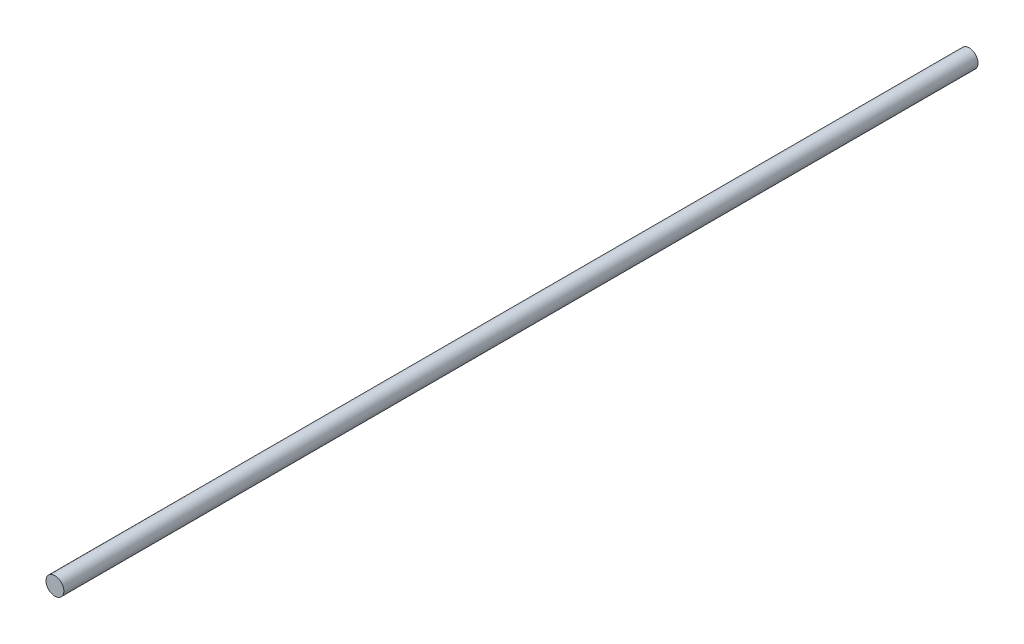
ISO-10303-21;
HEADER;
FILE_DESCRIPTION(('STEP AP214'),'2;1');
FILE_NAME('part.step','',(''),(''),'','','');
FILE_SCHEMA(('AUTOMOTIVE_DESIGN { 1 0 10303 214 1 1 1 1 }'));
ENDSEC;
DATA;
#1=APPLICATION_CONTEXT('core data for automotive mechanical design processes');
#2=APPLICATION_PROTOCOL_DEFINITION('international standard','automotive_design',2000,#1);
#3=PRODUCT_CONTEXT('',#1,'mechanical');
#4=PRODUCT('Part','Part','',(#3));
#5=PRODUCT_RELATED_PRODUCT_CATEGORY('part','',(#4));
#6=PRODUCT_DEFINITION_FORMATION('','',#4);
#7=PRODUCT_DEFINITION_CONTEXT('part definition',#1,'design');
#8=PRODUCT_DEFINITION('design','',#6,#7);
#9=PRODUCT_DEFINITION_SHAPE('','',#8);
#10=(LENGTH_UNIT() NAMED_UNIT(*) SI_UNIT(.MILLI.,.METRE.));
#11=(NAMED_UNIT(*) PLANE_ANGLE_UNIT() SI_UNIT($,.RADIAN.));
#12=(NAMED_UNIT(*) SI_UNIT($,.STERADIAN.) SOLID_ANGLE_UNIT());
#13=UNCERTAINTY_MEASURE_WITH_UNIT(LENGTH_MEASURE(1.E-05),#10,'distance_accuracy_value','');
#14=(GEOMETRIC_REPRESENTATION_CONTEXT(3) GLOBAL_UNCERTAINTY_ASSIGNED_CONTEXT((#13)) GLOBAL_UNIT_ASSIGNED_CONTEXT((#10,
#11,#12)) REPRESENTATION_CONTEXT('',''));
#15=CARTESIAN_POINT('',(0.,0.,0.));
#16=DIRECTION('',(0.,0.,1.));
#17=DIRECTION('',(1.,0.,0.));
#18=AXIS2_PLACEMENT_3D('',#15,#16,#17);
#19=CARTESIAN_POINT('',(0.,0.,410.));
#20=DIRECTION('',(0.,0.,-1.));
#21=DIRECTION('',(-1.,0.,0.));
#22=AXIS2_PLACEMENT_3D('',#19,#20,#21);
#23=CYLINDRICAL_SURFACE('',#22,4.);
#24=CARTESIAN_POINT('',(0.,0.,410.));
#25=DIRECTION('',(0.,0.,1.));
#26=DIRECTION('',(1.,0.,0.));
#27=AXIS2_PLACEMENT_3D('',#24,#25,#26);
#28=CIRCLE('',#27,4.);
#29=CARTESIAN_POINT('',(4.,0.,410.));
#30=VERTEX_POINT('',#29);
#31=EDGE_CURVE('E10',#30,#30,#28,.T.);
#32=ORIENTED_EDGE('',*,*,#31,.F.);
#33=EDGE_LOOP('',(#32));
#34=FACE_BOUND('',#33,.T.);
#35=CARTESIAN_POINT('',(0.,0.,0.));
#36=DIRECTION('',(0.,0.,1.));
#37=DIRECTION('',(1.,0.,0.));
#38=AXIS2_PLACEMENT_3D('',#35,#36,#37);
#39=CIRCLE('',#38,4.);
#40=CARTESIAN_POINT('',(4.,0.,0.));
#41=VERTEX_POINT('',#40);
#42=EDGE_CURVE('E41',#41,#41,#39,.T.);
#43=ORIENTED_EDGE('',*,*,#42,.T.);
#44=EDGE_LOOP('',(#43));
#45=FACE_BOUND('',#44,.T.);
#46=ADVANCED_FACE('F38',(#34,#45),#23,.T.);
#47=CARTESIAN_POINT('',(0.,0.,410.));
#48=DIRECTION('',(0.,0.,1.));
#49=DIRECTION('',(1.,0.,0.));
#50=AXIS2_PLACEMENT_3D('',#47,#48,#49);
#51=PLANE('',#50);
#52=ORIENTED_EDGE('',*,*,#31,.T.);
#53=EDGE_LOOP('',(#52));
#54=FACE_BOUND('',#53,.T.);
#55=ADVANCED_FACE('F55',(#54),#51,.T.);
#56=CARTESIAN_POINT('',(0.,0.,0.));
#57=DIRECTION('',(0.,0.,1.));
#58=DIRECTION('',(1.,0.,0.));
#59=AXIS2_PLACEMENT_3D('',#56,#57,#58);
#60=PLANE('',#59);
#61=ORIENTED_EDGE('',*,*,#42,.F.);
#62=EDGE_LOOP('',(#61));
#63=FACE_BOUND('',#62,.T.);
#64=ADVANCED_FACE('F53',(#63),#60,.F.);
#65=CLOSED_SHELL('',(#46,#55,#64));
#66=MANIFOLD_SOLID_BREP('B2',#65);
#67=ADVANCED_BREP_SHAPE_REPRESENTATION('',(#18,#66),#14);
#68=SHAPE_DEFINITION_REPRESENTATION(#9,#67);
ENDSEC;
END-ISO-10303-21;
